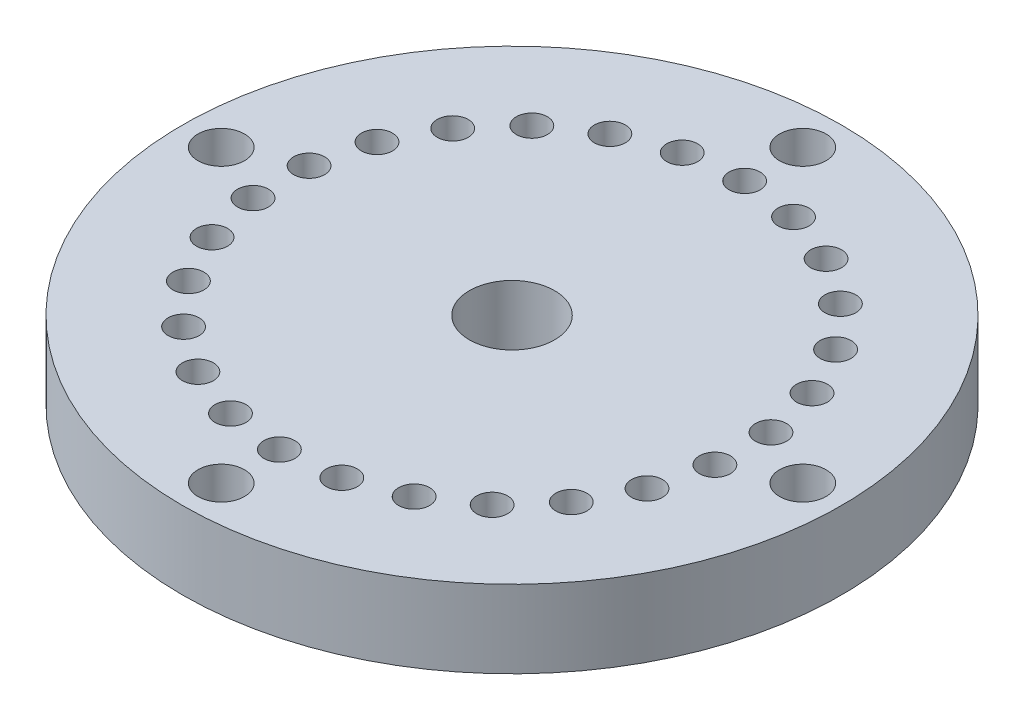
ISO-10303-21;
HEADER;
FILE_DESCRIPTION(('STEP AP214'),'2;1');
FILE_NAME('part.step','',(''),(''),'','','');
FILE_SCHEMA(('AUTOMOTIVE_DESIGN { 1 0 10303 214 1 1 1 1 }'));
ENDSEC;
DATA;
#1=APPLICATION_CONTEXT('core data for automotive mechanical design processes');
#2=APPLICATION_PROTOCOL_DEFINITION('international standard','automotive_design',2000,#1);
#3=PRODUCT_CONTEXT('',#1,'mechanical');
#4=PRODUCT('Part','Part','',(#3));
#5=PRODUCT_RELATED_PRODUCT_CATEGORY('part','',(#4));
#6=PRODUCT_DEFINITION_FORMATION('','',#4);
#7=PRODUCT_DEFINITION_CONTEXT('part definition',#1,'design');
#8=PRODUCT_DEFINITION('design','',#6,#7);
#9=PRODUCT_DEFINITION_SHAPE('','',#8);
#10=(LENGTH_UNIT() NAMED_UNIT(*) SI_UNIT(.MILLI.,.METRE.));
#11=(NAMED_UNIT(*) PLANE_ANGLE_UNIT() SI_UNIT($,.RADIAN.));
#12=(NAMED_UNIT(*) SI_UNIT($,.STERADIAN.) SOLID_ANGLE_UNIT());
#13=UNCERTAINTY_MEASURE_WITH_UNIT(LENGTH_MEASURE(1.E-05),#10,'distance_accuracy_value','');
#14=(GEOMETRIC_REPRESENTATION_CONTEXT(3) GLOBAL_UNCERTAINTY_ASSIGNED_CONTEXT((#13)) GLOBAL_UNIT_ASSIGNED_CONTEXT((#10,
#11,#12)) REPRESENTATION_CONTEXT('',''));
#15=CARTESIAN_POINT('',(0.,0.,0.));
#16=DIRECTION('',(0.,0.,1.));
#17=DIRECTION('',(1.,0.,0.));
#18=AXIS2_PLACEMENT_3D('',#15,#16,#17);
#19=CARTESIAN_POINT('',(0.,1.,0.));
#20=DIRECTION('',(0.,1.,0.));
#21=DIRECTION('',(0.,0.,1.));
#22=AXIS2_PLACEMENT_3D('',#19,#20,#21);
#23=PLANE('',#22);
#24=CARTESIAN_POINT('',(2.1224433562867E-13,1.,3.75));
#25=DIRECTION('',(0.,1.,0.));
#26=DIRECTION('',(0.,0.,1.));
#27=AXIS2_PLACEMENT_3D('',#24,#25,#26);
#28=CIRCLE('',#27,0.300000000000228);
#29=CARTESIAN_POINT('',(2.1224433562867E-13,1.,4.05000000000023));
#30=VERTEX_POINT('',#29);
#31=EDGE_CURVE('E217',#30,#30,#28,.T.);
#32=ORIENTED_EDGE('',*,*,#31,.F.);
#33=EDGE_LOOP('',(#32));
#34=FACE_BOUND('',#33,.T.);
#35=CARTESIAN_POINT('',(-0.717946992862634,1.,-2.91282545227817));
#36=DIRECTION('',(0.,1.,0.));
#37=DIRECTION('',(0.,0.,1.));
#38=AXIS2_PLACEMENT_3D('',#35,#36,#37);
#39=CIRCLE('',#38,0.2);
#40=CARTESIAN_POINT('',(-0.717946992862634,1.,-2.71282545227817));
#41=VERTEX_POINT('',#40);
#42=EDGE_CURVE('E205',#41,#41,#39,.T.);
#43=ORIENTED_EDGE('',*,*,#42,.F.);
#44=EDGE_LOOP('',(#43));
#45=FACE_BOUND('',#44,.T.);
#46=CARTESIAN_POINT('',(-1.98936797472234,1.,-2.24553224451319));
#47=DIRECTION('',(0.,1.,0.));
#48=DIRECTION('',(0.,0.,1.));
#49=AXIS2_PLACEMENT_3D('',#46,#47,#48);
#50=CIRCLE('',#49,0.20000000000011);
#51=CARTESIAN_POINT('',(-1.98936797472234,1.,-2.04553224451308));
#52=VERTEX_POINT('',#51);
#53=EDGE_CURVE('E193',#52,#52,#50,.T.);
#54=ORIENTED_EDGE('',*,*,#53,.F.);
#55=EDGE_LOOP('',(#54));
#56=FACE_BOUND('',#55,.T.);
#57=CARTESIAN_POINT('',(-2.80504872805614,1.,-1.06381466112745));
#58=DIRECTION('',(0.,1.,0.));
#59=DIRECTION('',(0.,0.,1.));
#60=AXIS2_PLACEMENT_3D('',#57,#58,#59);
#61=CIRCLE('',#60,0.200000000000185);
#62=CARTESIAN_POINT('',(-2.80504872805614,1.,-0.863814661127263));
#63=VERTEX_POINT('',#62);
#64=EDGE_CURVE('E181',#63,#63,#61,.T.);
#65=ORIENTED_EDGE('',*,*,#64,.F.);
#66=EDGE_LOOP('',(#65));
#67=FACE_BOUND('',#66,.T.);
#68=CARTESIAN_POINT('',(-2.97812662229397,1.,0.36161004076614));
#69=DIRECTION('',(0.,1.,0.));
#70=DIRECTION('',(0.,0.,1.));
#71=AXIS2_PLACEMENT_3D('',#68,#69,#70);
#72=CIRCLE('',#71,0.200000000000262);
#73=CARTESIAN_POINT('',(-2.97812662229397,1.,0.561610040766402));
#74=VERTEX_POINT('',#73);
#75=EDGE_CURVE('E169',#74,#74,#72,.T.);
#76=ORIENTED_EDGE('',*,*,#75,.F.);
#77=EDGE_LOOP('',(#76));
#78=FACE_BOUND('',#77,.T.);
#79=CARTESIAN_POINT('',(-2.4689515976807,1.,1.70419424019361));
#80=DIRECTION('',(0.,1.,0.));
#81=DIRECTION('',(0.,0.,1.));
#82=AXIS2_PLACEMENT_3D('',#79,#80,#81);
#83=CIRCLE('',#82,0.200000000000322);
#84=CARTESIAN_POINT('',(-2.4689515976807,1.,1.90419424019393));
#85=VERTEX_POINT('',#84);
#86=EDGE_CURVE('E157',#85,#85,#83,.T.);
#87=ORIENTED_EDGE('',*,*,#86,.F.);
#88=EDGE_LOOP('',(#87));
#89=FACE_BOUND('',#88,.T.);
#90=CARTESIAN_POINT('',(-1.39416951613099,1.,2.65636807695971));
#91=DIRECTION('',(0.,1.,0.));
#92=DIRECTION('',(0.,0.,1.));
#93=AXIS2_PLACEMENT_3D('',#90,#91,#92);
#94=CIRCLE('',#93,0.200000000000352);
#95=CARTESIAN_POINT('',(-1.39416951613099,1.,2.85636807696006));
#96=VERTEX_POINT('',#95);
#97=EDGE_CURVE('E145',#96,#96,#94,.T.);
#98=ORIENTED_EDGE('',*,*,#97,.F.);
#99=EDGE_LOOP('',(#98));
#100=FACE_BOUND('',#99,.T.);
#101=CARTESIAN_POINT('',(3.4032572508536E-13,1.,3.));
#102=DIRECTION('',(0.,1.,0.));
#103=DIRECTION('',(0.,0.,1.));
#104=AXIS2_PLACEMENT_3D('',#101,#102,#103);
#105=CIRCLE('',#104,0.200000000000346);
#106=CARTESIAN_POINT('',(3.4032572508536E-13,1.,3.20000000000035));
#107=VERTEX_POINT('',#106);
#108=EDGE_CURVE('E133',#107,#107,#105,.T.);
#109=ORIENTED_EDGE('',*,*,#108,.F.);
#110=EDGE_LOOP('',(#109));
#111=FACE_BOUND('',#110,.T.);
#112=CARTESIAN_POINT('',(1.39416951613163,1.,2.65636807695955));
#113=DIRECTION('',(0.,1.,0.));
#114=DIRECTION('',(0.,0.,1.));
#115=AXIS2_PLACEMENT_3D('',#112,#113,#114);
#116=CIRCLE('',#115,0.200000000000302);
#117=CARTESIAN_POINT('',(1.39416951613163,1.,2.85636807695985));
#118=VERTEX_POINT('',#117);
#119=EDGE_CURVE('E121',#118,#118,#116,.T.);
#120=ORIENTED_EDGE('',*,*,#119,.F.);
#121=EDGE_LOOP('',(#120));
#122=FACE_BOUND('',#121,.T.);
#123=CARTESIAN_POINT('',(2.46895159768124,1.,1.70419424019333));
#124=DIRECTION('',(0.,1.,0.));
#125=DIRECTION('',(0.,0.,1.));
#126=AXIS2_PLACEMENT_3D('',#123,#124,#125);
#127=CIRCLE('',#126,0.200000000000228);
#128=CARTESIAN_POINT('',(2.46895159768124,1.,1.90419424019356));
#129=VERTEX_POINT('',#128);
#130=EDGE_CURVE('E109',#129,#129,#127,.T.);
#131=ORIENTED_EDGE('',*,*,#130,.F.);
#132=EDGE_LOOP('',(#131));
#133=FACE_BOUND('',#132,.T.);
#134=CARTESIAN_POINT('',(2.97812662229435,1.,0.3616100407658));
#135=DIRECTION('',(0.,1.,0.));
#136=DIRECTION('',(0.,0.,1.));
#137=AXIS2_PLACEMENT_3D('',#134,#135,#136);
#138=CIRCLE('',#137,0.200000000000144);
#139=CARTESIAN_POINT('',(2.97812662229435,1.,0.561610040765944));
#140=VERTEX_POINT('',#139);
#141=EDGE_CURVE('E97',#140,#140,#138,.T.);
#142=ORIENTED_EDGE('',*,*,#141,.F.);
#143=EDGE_LOOP('',(#142));
#144=FACE_BOUND('',#143,.T.);
#145=CARTESIAN_POINT('',(2.80504872805635,1.,-1.06381466112777));
#146=DIRECTION('',(0.,1.,0.));
#147=DIRECTION('',(0.,0.,1.));
#148=AXIS2_PLACEMENT_3D('',#145,#146,#147);
#149=CIRCLE('',#148,0.200000000000066);
#150=CARTESIAN_POINT('',(2.80504872805635,1.,-0.8638146611277));
#151=VERTEX_POINT('',#150);
#152=EDGE_CURVE('E85',#151,#151,#149,.T.);
#153=ORIENTED_EDGE('',*,*,#152,.F.);
#154=EDGE_LOOP('',(#153));
#155=FACE_BOUND('',#154,.T.);
#156=CARTESIAN_POINT('',(1.98936797472243,1.,-2.24553224451342));
#157=DIRECTION('',(0.,1.,0.));
#158=DIRECTION('',(0.,0.,1.));
#159=AXIS2_PLACEMENT_3D('',#156,#157,#158);
#160=CIRCLE('',#159,0.200000000000013);
#161=CARTESIAN_POINT('',(1.98936797472243,1.,-2.0455322445134));
#162=VERTEX_POINT('',#161);
#163=EDGE_CURVE('E73',#162,#162,#160,.T.);
#164=ORIENTED_EDGE('',*,*,#163,.F.);
#165=EDGE_LOOP('',(#164));
#166=FACE_BOUND('',#165,.T.);
#167=CARTESIAN_POINT('',(0.717946992862675,1.,-2.91282545227816));
#168=DIRECTION('',(0.,1.,0.));
#169=DIRECTION('',(0.,0.,1.));
#170=AXIS2_PLACEMENT_3D('',#167,#168,#169);
#171=CIRCLE('',#170,0.2);
#172=CARTESIAN_POINT('',(0.717946992862675,1.,-2.71282545227816));
#173=VERTEX_POINT('',#172);
#174=EDGE_CURVE('E61',#173,#173,#171,.T.);
#175=ORIENTED_EDGE('',*,*,#174,.F.);
#176=EDGE_LOOP('',(#175));
#177=FACE_BOUND('',#176,.T.);
#178=CARTESIAN_POINT('',(0.,1.,-3.75));
#179=DIRECTION('',(0.,1.,0.));
#180=DIRECTION('',(0.,0.,1.));
#181=AXIS2_PLACEMENT_3D('',#178,#179,#180);
#182=CIRCLE('',#181,0.3);
#183=CARTESIAN_POINT('',(0.,1.,-3.45));
#184=VERTEX_POINT('',#183);
#185=EDGE_CURVE('E49',#184,#184,#182,.T.);
#186=ORIENTED_EDGE('',*,*,#185,.F.);
#187=EDGE_LOOP('',(#186));
#188=FACE_BOUND('',#187,.T.);
#189=CARTESIAN_POINT('',(0.,1.,0.));
#190=DIRECTION('',(0.,1.,0.));
#191=DIRECTION('',(0.,0.,1.));
#192=AXIS2_PLACEMENT_3D('',#189,#190,#191);
#193=CIRCLE('',#192,4.25);
#194=CARTESIAN_POINT('',(0.,1.,4.25));
#195=VERTEX_POINT('',#194);
#196=EDGE_CURVE('E10',#195,#195,#193,.T.);
#197=ORIENTED_EDGE('',*,*,#196,.T.);
#198=EDGE_LOOP('',(#197));
#199=FACE_BOUND('',#198,.T.);
#200=CARTESIAN_POINT('',(0.,1.,0.));
#201=DIRECTION('',(0.,1.,0.));
#202=DIRECTION('',(0.,0.,1.));
#203=AXIS2_PLACEMENT_3D('',#200,#201,#202);
#204=CIRCLE('',#203,0.55);
#205=CARTESIAN_POINT('',(0.,1.,0.55));
#206=VERTEX_POINT('',#205);
#207=EDGE_CURVE('E44',#206,#206,#204,.T.);
#208=ORIENTED_EDGE('',*,*,#207,.F.);
#209=EDGE_LOOP('',(#208));
#210=FACE_BOUND('',#209,.T.);
#211=CARTESIAN_POINT('',(0.,1.,-3.));
#212=DIRECTION('',(0.,1.,0.));
#213=DIRECTION('',(0.,0.,1.));
#214=AXIS2_PLACEMENT_3D('',#211,#212,#213);
#215=CIRCLE('',#214,0.2);
#216=CARTESIAN_POINT('',(0.,1.,-2.8));
#217=VERTEX_POINT('',#216);
#218=EDGE_CURVE('E55',#217,#217,#215,.T.);
#219=ORIENTED_EDGE('',*,*,#218,.F.);
#220=EDGE_LOOP('',(#219));
#221=FACE_BOUND('',#220,.T.);
#222=CARTESIAN_POINT('',(1.39416951613133,1.,-2.65636807695971));
#223=DIRECTION('',(0.,1.,0.));
#224=DIRECTION('',(0.,0.,1.));
#225=AXIS2_PLACEMENT_3D('',#222,#223,#224);
#226=CIRCLE('',#225,0.199999999999999);
#227=CARTESIAN_POINT('',(1.39416951613133,1.,-2.45636807695971));
#228=VERTEX_POINT('',#227);
#229=EDGE_CURVE('E67',#228,#228,#226,.T.);
#230=ORIENTED_EDGE('',*,*,#229,.F.);
#231=EDGE_LOOP('',(#230));
#232=FACE_BOUND('',#231,.T.);
#233=CARTESIAN_POINT('',(2.46895159768104,1.,-1.70419424019361));
#234=DIRECTION('',(0.,1.,0.));
#235=DIRECTION('',(0.,0.,1.));
#236=AXIS2_PLACEMENT_3D('',#233,#234,#235);
#237=CIRCLE('',#236,0.200000000000036);
#238=CARTESIAN_POINT('',(2.46895159768104,1.,-1.50419424019357));
#239=VERTEX_POINT('',#238);
#240=EDGE_CURVE('E79',#239,#239,#237,.T.);
#241=ORIENTED_EDGE('',*,*,#240,.F.);
#242=EDGE_LOOP('',(#241));
#243=FACE_BOUND('',#242,.T.);
#244=CARTESIAN_POINT('',(2.97812662229431,1.,-0.361610040766138));
#245=DIRECTION('',(0.,1.,0.));
#246=DIRECTION('',(0.,0.,1.));
#247=AXIS2_PLACEMENT_3D('',#244,#245,#246);
#248=CIRCLE('',#247,0.200000000000103);
#249=CARTESIAN_POINT('',(2.97812662229431,1.,-0.161610040766035));
#250=VERTEX_POINT('',#249);
#251=EDGE_CURVE('E91',#250,#250,#248,.T.);
#252=ORIENTED_EDGE('',*,*,#251,.F.);
#253=EDGE_LOOP('',(#252));
#254=FACE_BOUND('',#253,.T.);
#255=CARTESIAN_POINT('',(2.80504872805647,1.,1.06381466112745));
#256=DIRECTION('',(0.,1.,0.));
#257=DIRECTION('',(0.,0.,1.));
#258=AXIS2_PLACEMENT_3D('',#255,#256,#257);
#259=CIRCLE('',#258,0.200000000000187);
#260=CARTESIAN_POINT('',(2.80504872805647,1.,1.26381466112763));
#261=VERTEX_POINT('',#260);
#262=EDGE_CURVE('E103',#261,#261,#259,.T.);
#263=ORIENTED_EDGE('',*,*,#262,.F.);
#264=EDGE_LOOP('',(#263));
#265=FACE_BOUND('',#264,.T.);
#266=CARTESIAN_POINT('',(1.98936797472268,1.,2.24553224451319));
#267=DIRECTION('',(0.,1.,0.));
#268=DIRECTION('',(0.,0.,1.));
#269=AXIS2_PLACEMENT_3D('',#266,#267,#268);
#270=CIRCLE('',#269,0.200000000000268);
#271=CARTESIAN_POINT('',(1.98936797472268,1.,2.44553224451346));
#272=VERTEX_POINT('',#271);
#273=EDGE_CURVE('E115',#272,#272,#270,.T.);
#274=ORIENTED_EDGE('',*,*,#273,.F.);
#275=EDGE_LOOP('',(#274));
#276=FACE_BOUND('',#275,.T.);
#277=CARTESIAN_POINT('',(0.717946992863009,1.,2.91282545227812));
#278=DIRECTION('',(0.,1.,0.));
#279=DIRECTION('',(0.,0.,1.));
#280=AXIS2_PLACEMENT_3D('',#277,#278,#279);
#281=CIRCLE('',#280,0.200000000000327);
#282=CARTESIAN_POINT('',(0.717946992863009,1.,3.11282545227844));
#283=VERTEX_POINT('',#282);
#284=EDGE_CURVE('E127',#283,#283,#281,.T.);
#285=ORIENTED_EDGE('',*,*,#284,.F.);
#286=EDGE_LOOP('',(#285));
#287=FACE_BOUND('',#286,.T.);
#288=CARTESIAN_POINT('',(-0.717946992862337,1.,2.9128254522782));
#289=DIRECTION('',(0.,1.,0.));
#290=DIRECTION('',(0.,0.,1.));
#291=AXIS2_PLACEMENT_3D('',#288,#289,#290);
#292=CIRCLE('',#291,0.200000000000355);
#293=CARTESIAN_POINT('',(-0.717946992862337,1.,3.11282545227855));
#294=VERTEX_POINT('',#293);
#295=EDGE_CURVE('E139',#294,#294,#292,.T.);
#296=ORIENTED_EDGE('',*,*,#295,.F.);
#297=EDGE_LOOP('',(#296));
#298=FACE_BOUND('',#297,.T.);
#299=CARTESIAN_POINT('',(-1.98936797472209,1.,2.24553224451342));
#300=DIRECTION('',(0.,1.,0.));
#301=DIRECTION('',(0.,0.,1.));
#302=AXIS2_PLACEMENT_3D('',#299,#300,#301);
#303=CIRCLE('',#302,0.200000000000342);
#304=CARTESIAN_POINT('',(-1.98936797472209,1.,2.44553224451376));
#305=VERTEX_POINT('',#304);
#306=EDGE_CURVE('E151',#305,#305,#303,.T.);
#307=ORIENTED_EDGE('',*,*,#306,.F.);
#308=EDGE_LOOP('',(#307));
#309=FACE_BOUND('',#308,.T.);
#310=CARTESIAN_POINT('',(-2.80504872805601,1.,1.06381466112777));
#311=DIRECTION('',(0.,1.,0.));
#312=DIRECTION('',(0.,0.,1.));
#313=AXIS2_PLACEMENT_3D('',#310,#311,#312);
#314=CIRCLE('',#313,0.200000000000295);
#315=CARTESIAN_POINT('',(-2.80504872805601,1.,1.26381466112806));
#316=VERTEX_POINT('',#315);
#317=EDGE_CURVE('E163',#316,#316,#314,.T.);
#318=ORIENTED_EDGE('',*,*,#317,.F.);
#319=EDGE_LOOP('',(#318));
#320=FACE_BOUND('',#319,.T.);
#321=CARTESIAN_POINT('',(-2.97812662229401,1.,-0.361610040765798));
#322=DIRECTION('',(0.,1.,0.));
#323=DIRECTION('',(0.,0.,1.));
#324=AXIS2_PLACEMENT_3D('',#321,#322,#323);
#325=CIRCLE('',#324,0.200000000000225);
#326=CARTESIAN_POINT('',(-2.97812662229401,1.,-0.161610040765573));
#327=VERTEX_POINT('',#326);
#328=EDGE_CURVE('E175',#327,#327,#325,.T.);
#329=ORIENTED_EDGE('',*,*,#328,.F.);
#330=EDGE_LOOP('',(#329));
#331=FACE_BOUND('',#330,.T.);
#332=CARTESIAN_POINT('',(-2.4689515976809,1.,-1.70419424019333));
#333=DIRECTION('',(0.,1.,0.));
#334=DIRECTION('',(0.,0.,1.));
#335=AXIS2_PLACEMENT_3D('',#332,#333,#334);
#336=CIRCLE('',#335,0.200000000000147);
#337=CARTESIAN_POINT('',(-2.4689515976809,1.,-1.50419424019318));
#338=VERTEX_POINT('',#337);
#339=EDGE_CURVE('E187',#338,#338,#336,.T.);
#340=ORIENTED_EDGE('',*,*,#339,.F.);
#341=EDGE_LOOP('',(#340));
#342=FACE_BOUND('',#341,.T.);
#343=CARTESIAN_POINT('',(-1.39416951613129,1.,-2.65636807695955));
#344=DIRECTION('',(0.,1.,0.));
#345=DIRECTION('',(0.,0.,1.));
#346=AXIS2_PLACEMENT_3D('',#343,#344,#345);
#347=CIRCLE('',#346,0.20000000000008);
#348=CARTESIAN_POINT('',(-1.39416951613129,1.,-2.45636807695947));
#349=VERTEX_POINT('',#348);
#350=EDGE_CURVE('E199',#349,#349,#347,.T.);
#351=ORIENTED_EDGE('',*,*,#350,.F.);
#352=EDGE_LOOP('',(#351));
#353=FACE_BOUND('',#352,.T.);
#354=CARTESIAN_POINT('',(3.75000000000011,1.,-1.06122167814335E-13));
#355=DIRECTION('',(0.,1.,0.));
#356=DIRECTION('',(0.,0.,1.));
#357=AXIS2_PLACEMENT_3D('',#354,#355,#356);
#358=CIRCLE('',#357,0.300000000000083);
#359=CARTESIAN_POINT('',(3.75000000000011,1.,0.299999999999977));
#360=VERTEX_POINT('',#359);
#361=EDGE_CURVE('E211',#360,#360,#358,.T.);
#362=ORIENTED_EDGE('',*,*,#361,.F.);
#363=EDGE_LOOP('',(#362));
#364=FACE_BOUND('',#363,.T.);
#365=CARTESIAN_POINT('',(-3.74999999999989,1.,1.06581410364015E-13));
#366=DIRECTION('',(0.,1.,0.));
#367=DIRECTION('',(0.,0.,1.));
#368=AXIS2_PLACEMENT_3D('',#365,#366,#367);
#369=CIRCLE('',#368,0.30000000000017);
#370=CARTESIAN_POINT('',(-3.74999999999989,1.,0.300000000000277));
#371=VERTEX_POINT('',#370);
#372=EDGE_CURVE('E223',#371,#371,#369,.T.);
#373=ORIENTED_EDGE('',*,*,#372,.F.);
#374=EDGE_LOOP('',(#373));
#375=FACE_BOUND('',#374,.T.);
#376=ADVANCED_FACE('F33',(#34,#45,#56,#67,#78,#89,#100,#111,#122,#133,#144,#155,#166,#177,#188,
#199,#210,#221,#232,#243,#254,#265,#276,#287,#298,#309,#320,#331,#342,#353,#364,#375),#23,.T.);
#377=CARTESIAN_POINT('',(0.,0.,0.));
#378=DIRECTION('',(0.,1.,0.));
#379=DIRECTION('',(0.,0.,1.));
#380=AXIS2_PLACEMENT_3D('',#377,#378,#379);
#381=PLANE('',#380);
#382=CARTESIAN_POINT('',(2.1224433562867E-13,0.,3.75));
#383=DIRECTION('',(0.,1.,0.));
#384=DIRECTION('',(0.,0.,1.));
#385=AXIS2_PLACEMENT_3D('',#382,#383,#384);
#386=CIRCLE('',#385,0.300000000000228);
#387=CARTESIAN_POINT('',(2.1224433562867E-13,0.,4.05000000000023));
#388=VERTEX_POINT('',#387);
#389=EDGE_CURVE('E220',#388,#388,#386,.T.);
#390=ORIENTED_EDGE('',*,*,#389,.T.);
#391=EDGE_LOOP('',(#390));
#392=FACE_BOUND('',#391,.T.);
#393=CARTESIAN_POINT('',(-0.717946992862634,0.,-2.91282545227817));
#394=DIRECTION('',(0.,1.,0.));
#395=DIRECTION('',(0.,0.,1.));
#396=AXIS2_PLACEMENT_3D('',#393,#394,#395);
#397=CIRCLE('',#396,0.2);
#398=CARTESIAN_POINT('',(-0.717946992862634,0.,-2.71282545227817));
#399=VERTEX_POINT('',#398);
#400=EDGE_CURVE('E208',#399,#399,#397,.T.);
#401=ORIENTED_EDGE('',*,*,#400,.T.);
#402=EDGE_LOOP('',(#401));
#403=FACE_BOUND('',#402,.T.);
#404=CARTESIAN_POINT('',(-1.98936797472234,0.,-2.24553224451319));
#405=DIRECTION('',(0.,1.,0.));
#406=DIRECTION('',(0.,0.,1.));
#407=AXIS2_PLACEMENT_3D('',#404,#405,#406);
#408=CIRCLE('',#407,0.20000000000011);
#409=CARTESIAN_POINT('',(-1.98936797472234,0.,-2.04553224451308));
#410=VERTEX_POINT('',#409);
#411=EDGE_CURVE('E196',#410,#410,#408,.T.);
#412=ORIENTED_EDGE('',*,*,#411,.T.);
#413=EDGE_LOOP('',(#412));
#414=FACE_BOUND('',#413,.T.);
#415=CARTESIAN_POINT('',(-2.80504872805614,0.,-1.06381466112745));
#416=DIRECTION('',(0.,1.,0.));
#417=DIRECTION('',(0.,0.,1.));
#418=AXIS2_PLACEMENT_3D('',#415,#416,#417);
#419=CIRCLE('',#418,0.200000000000185);
#420=CARTESIAN_POINT('',(-2.80504872805614,0.,-0.863814661127263));
#421=VERTEX_POINT('',#420);
#422=EDGE_CURVE('E184',#421,#421,#419,.T.);
#423=ORIENTED_EDGE('',*,*,#422,.T.);
#424=EDGE_LOOP('',(#423));
#425=FACE_BOUND('',#424,.T.);
#426=CARTESIAN_POINT('',(-2.97812662229397,0.,0.36161004076614));
#427=DIRECTION('',(0.,1.,0.));
#428=DIRECTION('',(0.,0.,1.));
#429=AXIS2_PLACEMENT_3D('',#426,#427,#428);
#430=CIRCLE('',#429,0.200000000000262);
#431=CARTESIAN_POINT('',(-2.97812662229397,0.,0.561610040766402));
#432=VERTEX_POINT('',#431);
#433=EDGE_CURVE('E172',#432,#432,#430,.T.);
#434=ORIENTED_EDGE('',*,*,#433,.T.);
#435=EDGE_LOOP('',(#434));
#436=FACE_BOUND('',#435,.T.);
#437=CARTESIAN_POINT('',(-2.4689515976807,0.,1.70419424019361));
#438=DIRECTION('',(0.,1.,0.));
#439=DIRECTION('',(0.,0.,1.));
#440=AXIS2_PLACEMENT_3D('',#437,#438,#439);
#441=CIRCLE('',#440,0.200000000000322);
#442=CARTESIAN_POINT('',(-2.4689515976807,0.,1.90419424019393));
#443=VERTEX_POINT('',#442);
#444=EDGE_CURVE('E160',#443,#443,#441,.T.);
#445=ORIENTED_EDGE('',*,*,#444,.T.);
#446=EDGE_LOOP('',(#445));
#447=FACE_BOUND('',#446,.T.);
#448=CARTESIAN_POINT('',(-1.39416951613099,0.,2.65636807695971));
#449=DIRECTION('',(0.,1.,0.));
#450=DIRECTION('',(0.,0.,1.));
#451=AXIS2_PLACEMENT_3D('',#448,#449,#450);
#452=CIRCLE('',#451,0.200000000000352);
#453=CARTESIAN_POINT('',(-1.39416951613099,0.,2.85636807696006));
#454=VERTEX_POINT('',#453);
#455=EDGE_CURVE('E148',#454,#454,#452,.T.);
#456=ORIENTED_EDGE('',*,*,#455,.T.);
#457=EDGE_LOOP('',(#456));
#458=FACE_BOUND('',#457,.T.);
#459=CARTESIAN_POINT('',(3.4032572508536E-13,0.,3.));
#460=DIRECTION('',(0.,1.,0.));
#461=DIRECTION('',(0.,0.,1.));
#462=AXIS2_PLACEMENT_3D('',#459,#460,#461);
#463=CIRCLE('',#462,0.200000000000346);
#464=CARTESIAN_POINT('',(3.4032572508536E-13,0.,3.20000000000035));
#465=VERTEX_POINT('',#464);
#466=EDGE_CURVE('E136',#465,#465,#463,.T.);
#467=ORIENTED_EDGE('',*,*,#466,.T.);
#468=EDGE_LOOP('',(#467));
#469=FACE_BOUND('',#468,.T.);
#470=CARTESIAN_POINT('',(1.39416951613163,0.,2.65636807695955));
#471=DIRECTION('',(0.,1.,0.));
#472=DIRECTION('',(0.,0.,1.));
#473=AXIS2_PLACEMENT_3D('',#470,#471,#472);
#474=CIRCLE('',#473,0.200000000000302);
#475=CARTESIAN_POINT('',(1.39416951613163,0.,2.85636807695985));
#476=VERTEX_POINT('',#475);
#477=EDGE_CURVE('E124',#476,#476,#474,.T.);
#478=ORIENTED_EDGE('',*,*,#477,.T.);
#479=EDGE_LOOP('',(#478));
#480=FACE_BOUND('',#479,.T.);
#481=CARTESIAN_POINT('',(2.46895159768124,0.,1.70419424019333));
#482=DIRECTION('',(0.,1.,0.));
#483=DIRECTION('',(0.,0.,1.));
#484=AXIS2_PLACEMENT_3D('',#481,#482,#483);
#485=CIRCLE('',#484,0.200000000000228);
#486=CARTESIAN_POINT('',(2.46895159768124,0.,1.90419424019356));
#487=VERTEX_POINT('',#486);
#488=EDGE_CURVE('E112',#487,#487,#485,.T.);
#489=ORIENTED_EDGE('',*,*,#488,.T.);
#490=EDGE_LOOP('',(#489));
#491=FACE_BOUND('',#490,.T.);
#492=CARTESIAN_POINT('',(2.97812662229435,0.,0.3616100407658));
#493=DIRECTION('',(0.,1.,0.));
#494=DIRECTION('',(0.,0.,1.));
#495=AXIS2_PLACEMENT_3D('',#492,#493,#494);
#496=CIRCLE('',#495,0.200000000000144);
#497=CARTESIAN_POINT('',(2.97812662229435,0.,0.561610040765944));
#498=VERTEX_POINT('',#497);
#499=EDGE_CURVE('E100',#498,#498,#496,.T.);
#500=ORIENTED_EDGE('',*,*,#499,.T.);
#501=EDGE_LOOP('',(#500));
#502=FACE_BOUND('',#501,.T.);
#503=CARTESIAN_POINT('',(2.80504872805635,0.,-1.06381466112777));
#504=DIRECTION('',(0.,1.,0.));
#505=DIRECTION('',(0.,0.,1.));
#506=AXIS2_PLACEMENT_3D('',#503,#504,#505);
#507=CIRCLE('',#506,0.200000000000066);
#508=CARTESIAN_POINT('',(2.80504872805635,0.,-0.8638146611277));
#509=VERTEX_POINT('',#508);
#510=EDGE_CURVE('E88',#509,#509,#507,.T.);
#511=ORIENTED_EDGE('',*,*,#510,.T.);
#512=EDGE_LOOP('',(#511));
#513=FACE_BOUND('',#512,.T.);
#514=CARTESIAN_POINT('',(1.98936797472243,0.,-2.24553224451342));
#515=DIRECTION('',(0.,1.,0.));
#516=DIRECTION('',(0.,0.,1.));
#517=AXIS2_PLACEMENT_3D('',#514,#515,#516);
#518=CIRCLE('',#517,0.200000000000013);
#519=CARTESIAN_POINT('',(1.98936797472243,0.,-2.0455322445134));
#520=VERTEX_POINT('',#519);
#521=EDGE_CURVE('E76',#520,#520,#518,.T.);
#522=ORIENTED_EDGE('',*,*,#521,.T.);
#523=EDGE_LOOP('',(#522));
#524=FACE_BOUND('',#523,.T.);
#525=CARTESIAN_POINT('',(0.717946992862675,0.,-2.91282545227816));
#526=DIRECTION('',(0.,1.,0.));
#527=DIRECTION('',(0.,0.,1.));
#528=AXIS2_PLACEMENT_3D('',#525,#526,#527);
#529=CIRCLE('',#528,0.2);
#530=CARTESIAN_POINT('',(0.717946992862675,0.,-2.71282545227816));
#531=VERTEX_POINT('',#530);
#532=EDGE_CURVE('E64',#531,#531,#529,.T.);
#533=ORIENTED_EDGE('',*,*,#532,.T.);
#534=EDGE_LOOP('',(#533));
#535=FACE_BOUND('',#534,.T.);
#536=CARTESIAN_POINT('',(0.,0.,-3.75));
#537=DIRECTION('',(0.,1.,0.));
#538=DIRECTION('',(0.,0.,1.));
#539=AXIS2_PLACEMENT_3D('',#536,#537,#538);
#540=CIRCLE('',#539,0.3);
#541=CARTESIAN_POINT('',(0.,0.,-3.45));
#542=VERTEX_POINT('',#541);
#543=EDGE_CURVE('E52',#542,#542,#540,.T.);
#544=ORIENTED_EDGE('',*,*,#543,.T.);
#545=EDGE_LOOP('',(#544));
#546=FACE_BOUND('',#545,.T.);
#547=CARTESIAN_POINT('',(0.,0.,0.));
#548=DIRECTION('',(0.,1.,0.));
#549=DIRECTION('',(0.,0.,1.));
#550=AXIS2_PLACEMENT_3D('',#547,#548,#549);
#551=CIRCLE('',#550,4.25);
#552=CARTESIAN_POINT('',(0.,0.,4.25));
#553=VERTEX_POINT('',#552);
#554=EDGE_CURVE('E37',#553,#553,#551,.T.);
#555=ORIENTED_EDGE('',*,*,#554,.F.);
#556=EDGE_LOOP('',(#555));
#557=FACE_BOUND('',#556,.T.);
#558=CARTESIAN_POINT('',(0.,0.,0.));
#559=DIRECTION('',(0.,1.,0.));
#560=DIRECTION('',(0.,0.,1.));
#561=AXIS2_PLACEMENT_3D('',#558,#559,#560);
#562=CIRCLE('',#561,0.55);
#563=CARTESIAN_POINT('',(0.,0.,0.55));
#564=VERTEX_POINT('',#563);
#565=EDGE_CURVE('E46',#564,#564,#562,.T.);
#566=ORIENTED_EDGE('',*,*,#565,.T.);
#567=EDGE_LOOP('',(#566));
#568=FACE_BOUND('',#567,.T.);
#569=CARTESIAN_POINT('',(0.,0.,-3.));
#570=DIRECTION('',(0.,1.,0.));
#571=DIRECTION('',(0.,0.,1.));
#572=AXIS2_PLACEMENT_3D('',#569,#570,#571);
#573=CIRCLE('',#572,0.2);
#574=CARTESIAN_POINT('',(0.,0.,-2.8));
#575=VERTEX_POINT('',#574);
#576=EDGE_CURVE('E58',#575,#575,#573,.T.);
#577=ORIENTED_EDGE('',*,*,#576,.T.);
#578=EDGE_LOOP('',(#577));
#579=FACE_BOUND('',#578,.T.);
#580=CARTESIAN_POINT('',(1.39416951613133,0.,-2.65636807695971));
#581=DIRECTION('',(0.,1.,0.));
#582=DIRECTION('',(0.,0.,1.));
#583=AXIS2_PLACEMENT_3D('',#580,#581,#582);
#584=CIRCLE('',#583,0.199999999999999);
#585=CARTESIAN_POINT('',(1.39416951613133,0.,-2.45636807695971));
#586=VERTEX_POINT('',#585);
#587=EDGE_CURVE('E70',#586,#586,#584,.T.);
#588=ORIENTED_EDGE('',*,*,#587,.T.);
#589=EDGE_LOOP('',(#588));
#590=FACE_BOUND('',#589,.T.);
#591=CARTESIAN_POINT('',(2.46895159768104,0.,-1.70419424019361));
#592=DIRECTION('',(0.,1.,0.));
#593=DIRECTION('',(0.,0.,1.));
#594=AXIS2_PLACEMENT_3D('',#591,#592,#593);
#595=CIRCLE('',#594,0.200000000000036);
#596=CARTESIAN_POINT('',(2.46895159768104,0.,-1.50419424019357));
#597=VERTEX_POINT('',#596);
#598=EDGE_CURVE('E82',#597,#597,#595,.T.);
#599=ORIENTED_EDGE('',*,*,#598,.T.);
#600=EDGE_LOOP('',(#599));
#601=FACE_BOUND('',#600,.T.);
#602=CARTESIAN_POINT('',(2.97812662229431,0.,-0.361610040766138));
#603=DIRECTION('',(0.,1.,0.));
#604=DIRECTION('',(0.,0.,1.));
#605=AXIS2_PLACEMENT_3D('',#602,#603,#604);
#606=CIRCLE('',#605,0.200000000000103);
#607=CARTESIAN_POINT('',(2.97812662229431,0.,-0.161610040766035));
#608=VERTEX_POINT('',#607);
#609=EDGE_CURVE('E94',#608,#608,#606,.T.);
#610=ORIENTED_EDGE('',*,*,#609,.T.);
#611=EDGE_LOOP('',(#610));
#612=FACE_BOUND('',#611,.T.);
#613=CARTESIAN_POINT('',(2.80504872805647,0.,1.06381466112745));
#614=DIRECTION('',(0.,1.,0.));
#615=DIRECTION('',(0.,0.,1.));
#616=AXIS2_PLACEMENT_3D('',#613,#614,#615);
#617=CIRCLE('',#616,0.200000000000187);
#618=CARTESIAN_POINT('',(2.80504872805647,0.,1.26381466112763));
#619=VERTEX_POINT('',#618);
#620=EDGE_CURVE('E106',#619,#619,#617,.T.);
#621=ORIENTED_EDGE('',*,*,#620,.T.);
#622=EDGE_LOOP('',(#621));
#623=FACE_BOUND('',#622,.T.);
#624=CARTESIAN_POINT('',(1.98936797472268,0.,2.24553224451319));
#625=DIRECTION('',(0.,1.,0.));
#626=DIRECTION('',(0.,0.,1.));
#627=AXIS2_PLACEMENT_3D('',#624,#625,#626);
#628=CIRCLE('',#627,0.200000000000268);
#629=CARTESIAN_POINT('',(1.98936797472268,0.,2.44553224451346));
#630=VERTEX_POINT('',#629);
#631=EDGE_CURVE('E118',#630,#630,#628,.T.);
#632=ORIENTED_EDGE('',*,*,#631,.T.);
#633=EDGE_LOOP('',(#632));
#634=FACE_BOUND('',#633,.T.);
#635=CARTESIAN_POINT('',(0.717946992863009,0.,2.91282545227812));
#636=DIRECTION('',(0.,1.,0.));
#637=DIRECTION('',(0.,0.,1.));
#638=AXIS2_PLACEMENT_3D('',#635,#636,#637);
#639=CIRCLE('',#638,0.200000000000327);
#640=CARTESIAN_POINT('',(0.717946992863009,0.,3.11282545227844));
#641=VERTEX_POINT('',#640);
#642=EDGE_CURVE('E130',#641,#641,#639,.T.);
#643=ORIENTED_EDGE('',*,*,#642,.T.);
#644=EDGE_LOOP('',(#643));
#645=FACE_BOUND('',#644,.T.);
#646=CARTESIAN_POINT('',(-0.717946992862337,0.,2.9128254522782));
#647=DIRECTION('',(0.,1.,0.));
#648=DIRECTION('',(0.,0.,1.));
#649=AXIS2_PLACEMENT_3D('',#646,#647,#648);
#650=CIRCLE('',#649,0.200000000000355);
#651=CARTESIAN_POINT('',(-0.717946992862337,0.,3.11282545227855));
#652=VERTEX_POINT('',#651);
#653=EDGE_CURVE('E142',#652,#652,#650,.T.);
#654=ORIENTED_EDGE('',*,*,#653,.T.);
#655=EDGE_LOOP('',(#654));
#656=FACE_BOUND('',#655,.T.);
#657=CARTESIAN_POINT('',(-1.98936797472209,0.,2.24553224451342));
#658=DIRECTION('',(0.,1.,0.));
#659=DIRECTION('',(0.,0.,1.));
#660=AXIS2_PLACEMENT_3D('',#657,#658,#659);
#661=CIRCLE('',#660,0.200000000000342);
#662=CARTESIAN_POINT('',(-1.98936797472209,0.,2.44553224451376));
#663=VERTEX_POINT('',#662);
#664=EDGE_CURVE('E154',#663,#663,#661,.T.);
#665=ORIENTED_EDGE('',*,*,#664,.T.);
#666=EDGE_LOOP('',(#665));
#667=FACE_BOUND('',#666,.T.);
#668=CARTESIAN_POINT('',(-2.80504872805601,0.,1.06381466112777));
#669=DIRECTION('',(0.,1.,0.));
#670=DIRECTION('',(0.,0.,1.));
#671=AXIS2_PLACEMENT_3D('',#668,#669,#670);
#672=CIRCLE('',#671,0.200000000000295);
#673=CARTESIAN_POINT('',(-2.80504872805601,0.,1.26381466112806));
#674=VERTEX_POINT('',#673);
#675=EDGE_CURVE('E166',#674,#674,#672,.T.);
#676=ORIENTED_EDGE('',*,*,#675,.T.);
#677=EDGE_LOOP('',(#676));
#678=FACE_BOUND('',#677,.T.);
#679=CARTESIAN_POINT('',(-2.97812662229401,0.,-0.361610040765798));
#680=DIRECTION('',(0.,1.,0.));
#681=DIRECTION('',(0.,0.,1.));
#682=AXIS2_PLACEMENT_3D('',#679,#680,#681);
#683=CIRCLE('',#682,0.200000000000225);
#684=CARTESIAN_POINT('',(-2.97812662229401,0.,-0.161610040765573));
#685=VERTEX_POINT('',#684);
#686=EDGE_CURVE('E178',#685,#685,#683,.T.);
#687=ORIENTED_EDGE('',*,*,#686,.T.);
#688=EDGE_LOOP('',(#687));
#689=FACE_BOUND('',#688,.T.);
#690=CARTESIAN_POINT('',(-2.4689515976809,0.,-1.70419424019333));
#691=DIRECTION('',(0.,1.,0.));
#692=DIRECTION('',(0.,0.,1.));
#693=AXIS2_PLACEMENT_3D('',#690,#691,#692);
#694=CIRCLE('',#693,0.200000000000147);
#695=CARTESIAN_POINT('',(-2.4689515976809,0.,-1.50419424019318));
#696=VERTEX_POINT('',#695);
#697=EDGE_CURVE('E190',#696,#696,#694,.T.);
#698=ORIENTED_EDGE('',*,*,#697,.T.);
#699=EDGE_LOOP('',(#698));
#700=FACE_BOUND('',#699,.T.);
#701=CARTESIAN_POINT('',(-1.39416951613129,0.,-2.65636807695955));
#702=DIRECTION('',(0.,1.,0.));
#703=DIRECTION('',(0.,0.,1.));
#704=AXIS2_PLACEMENT_3D('',#701,#702,#703);
#705=CIRCLE('',#704,0.20000000000008);
#706=CARTESIAN_POINT('',(-1.39416951613129,0.,-2.45636807695947));
#707=VERTEX_POINT('',#706);
#708=EDGE_CURVE('E202',#707,#707,#705,.T.);
#709=ORIENTED_EDGE('',*,*,#708,.T.);
#710=EDGE_LOOP('',(#709));
#711=FACE_BOUND('',#710,.T.);
#712=CARTESIAN_POINT('',(3.75000000000011,0.,-1.06122167814335E-13));
#713=DIRECTION('',(0.,1.,0.));
#714=DIRECTION('',(0.,0.,1.));
#715=AXIS2_PLACEMENT_3D('',#712,#713,#714);
#716=CIRCLE('',#715,0.300000000000083);
#717=CARTESIAN_POINT('',(3.75000000000011,0.,0.299999999999977));
#718=VERTEX_POINT('',#717);
#719=EDGE_CURVE('E214',#718,#718,#716,.T.);
#720=ORIENTED_EDGE('',*,*,#719,.T.);
#721=EDGE_LOOP('',(#720));
#722=FACE_BOUND('',#721,.T.);
#723=CARTESIAN_POINT('',(-3.74999999999989,0.,1.06581410364015E-13));
#724=DIRECTION('',(0.,1.,0.));
#725=DIRECTION('',(0.,0.,1.));
#726=AXIS2_PLACEMENT_3D('',#723,#724,#725);
#727=CIRCLE('',#726,0.30000000000017);
#728=CARTESIAN_POINT('',(-3.74999999999989,0.,0.300000000000277));
#729=VERTEX_POINT('',#728);
#730=EDGE_CURVE('E226',#729,#729,#727,.T.);
#731=ORIENTED_EDGE('',*,*,#730,.T.);
#732=EDGE_LOOP('',(#731));
#733=FACE_BOUND('',#732,.T.);
#734=ADVANCED_FACE('F236',(#392,#403,#414,#425,#436,#447,#458,#469,#480,#491,#502,#513,#524,
#535,#546,#557,#568,#579,#590,#601,#612,#623,#634,#645,#656,#667,#678,#689,#700,#711,#722,#733),
#381,.F.);
#735=CARTESIAN_POINT('',(0.,1.,0.));
#736=DIRECTION('',(0.,-1.,0.));
#737=DIRECTION('',(0.,0.,-1.));
#738=AXIS2_PLACEMENT_3D('',#735,#736,#737);
#739=CYLINDRICAL_SURFACE('',#738,4.25);
#740=ORIENTED_EDGE('',*,*,#196,.F.);
#741=EDGE_LOOP('',(#740));
#742=FACE_BOUND('',#741,.T.);
#743=ORIENTED_EDGE('',*,*,#554,.T.);
#744=EDGE_LOOP('',(#743));
#745=FACE_BOUND('',#744,.T.);
#746=ADVANCED_FACE('F35',(#742,#745),#739,.T.);
#747=CARTESIAN_POINT('',(0.,1.,0.));
#748=DIRECTION('',(0.,-1.,0.));
#749=DIRECTION('',(0.,0.,-1.));
#750=AXIS2_PLACEMENT_3D('',#747,#748,#749);
#751=CYLINDRICAL_SURFACE('',#750,0.55);
#752=ORIENTED_EDGE('',*,*,#207,.T.);
#753=EDGE_LOOP('',(#752));
#754=FACE_BOUND('',#753,.T.);
#755=ORIENTED_EDGE('',*,*,#565,.F.);
#756=EDGE_LOOP('',(#755));
#757=FACE_BOUND('',#756,.T.);
#758=ADVANCED_FACE('F246',(#754,#757),#751,.F.);
#759=CARTESIAN_POINT('',(0.,1.,-3.75));
#760=DIRECTION('',(0.,-1.,0.));
#761=DIRECTION('',(0.,0.,-1.));
#762=AXIS2_PLACEMENT_3D('',#759,#760,#761);
#763=CYLINDRICAL_SURFACE('',#762,0.3);
#764=ORIENTED_EDGE('',*,*,#185,.T.);
#765=EDGE_LOOP('',(#764));
#766=FACE_BOUND('',#765,.T.);
#767=ORIENTED_EDGE('',*,*,#543,.F.);
#768=EDGE_LOOP('',(#767));
#769=FACE_BOUND('',#768,.T.);
#770=ADVANCED_FACE('F249',(#766,#769),#763,.F.);
#771=CARTESIAN_POINT('',(0.,1.,-3.));
#772=DIRECTION('',(0.,-1.,0.));
#773=DIRECTION('',(0.,0.,-1.));
#774=AXIS2_PLACEMENT_3D('',#771,#772,#773);
#775=CYLINDRICAL_SURFACE('',#774,0.2);
#776=ORIENTED_EDGE('',*,*,#218,.T.);
#777=EDGE_LOOP('',(#776));
#778=FACE_BOUND('',#777,.T.);
#779=ORIENTED_EDGE('',*,*,#576,.F.);
#780=EDGE_LOOP('',(#779));
#781=FACE_BOUND('',#780,.T.);
#782=ADVANCED_FACE('F253',(#778,#781),#775,.F.);
#783=CARTESIAN_POINT('',(0.717946992862675,1.,-2.91282545227816));
#784=DIRECTION('',(0.,-1.,0.));
#785=DIRECTION('',(0.,0.,-1.));
#786=AXIS2_PLACEMENT_3D('',#783,#784,#785);
#787=CYLINDRICAL_SURFACE('',#786,0.2);
#788=ORIENTED_EDGE('',*,*,#174,.T.);
#789=EDGE_LOOP('',(#788));
#790=FACE_BOUND('',#789,.T.);
#791=ORIENTED_EDGE('',*,*,#532,.F.);
#792=EDGE_LOOP('',(#791));
#793=FACE_BOUND('',#792,.T.);
#794=ADVANCED_FACE('F257',(#790,#793),#787,.F.);
#795=CARTESIAN_POINT('',(1.39416951613133,1.,-2.65636807695971));
#796=DIRECTION('',(0.,-1.,0.));
#797=DIRECTION('',(0.,0.,-1.));
#798=AXIS2_PLACEMENT_3D('',#795,#796,#797);
#799=CYLINDRICAL_SURFACE('',#798,0.199999999999999);
#800=ORIENTED_EDGE('',*,*,#229,.T.);
#801=EDGE_LOOP('',(#800));
#802=FACE_BOUND('',#801,.T.);
#803=ORIENTED_EDGE('',*,*,#587,.F.);
#804=EDGE_LOOP('',(#803));
#805=FACE_BOUND('',#804,.T.);
#806=ADVANCED_FACE('F261',(#802,#805),#799,.F.);
#807=CARTESIAN_POINT('',(1.98936797472243,1.,-2.24553224451342));
#808=DIRECTION('',(0.,-1.,0.));
#809=DIRECTION('',(0.,0.,-1.));
#810=AXIS2_PLACEMENT_3D('',#807,#808,#809);
#811=CYLINDRICAL_SURFACE('',#810,0.200000000000013);
#812=ORIENTED_EDGE('',*,*,#163,.T.);
#813=EDGE_LOOP('',(#812));
#814=FACE_BOUND('',#813,.T.);
#815=ORIENTED_EDGE('',*,*,#521,.F.);
#816=EDGE_LOOP('',(#815));
#817=FACE_BOUND('',#816,.T.);
#818=ADVANCED_FACE('F265',(#814,#817),#811,.F.);
#819=CARTESIAN_POINT('',(2.46895159768104,1.,-1.70419424019361));
#820=DIRECTION('',(0.,-1.,0.));
#821=DIRECTION('',(0.,0.,-1.));
#822=AXIS2_PLACEMENT_3D('',#819,#820,#821);
#823=CYLINDRICAL_SURFACE('',#822,0.200000000000036);
#824=ORIENTED_EDGE('',*,*,#240,.T.);
#825=EDGE_LOOP('',(#824));
#826=FACE_BOUND('',#825,.T.);
#827=ORIENTED_EDGE('',*,*,#598,.F.);
#828=EDGE_LOOP('',(#827));
#829=FACE_BOUND('',#828,.T.);
#830=ADVANCED_FACE('F269',(#826,#829),#823,.F.);
#831=CARTESIAN_POINT('',(2.80504872805635,1.,-1.06381466112777));
#832=DIRECTION('',(0.,-1.,0.));
#833=DIRECTION('',(0.,0.,-1.));
#834=AXIS2_PLACEMENT_3D('',#831,#832,#833);
#835=CYLINDRICAL_SURFACE('',#834,0.200000000000066);
#836=ORIENTED_EDGE('',*,*,#152,.T.);
#837=EDGE_LOOP('',(#836));
#838=FACE_BOUND('',#837,.T.);
#839=ORIENTED_EDGE('',*,*,#510,.F.);
#840=EDGE_LOOP('',(#839));
#841=FACE_BOUND('',#840,.T.);
#842=ADVANCED_FACE('F273',(#838,#841),#835,.F.);
#843=CARTESIAN_POINT('',(2.97812662229431,1.,-0.361610040766138));
#844=DIRECTION('',(0.,-1.,0.));
#845=DIRECTION('',(0.,0.,-1.));
#846=AXIS2_PLACEMENT_3D('',#843,#844,#845);
#847=CYLINDRICAL_SURFACE('',#846,0.200000000000103);
#848=ORIENTED_EDGE('',*,*,#251,.T.);
#849=EDGE_LOOP('',(#848));
#850=FACE_BOUND('',#849,.T.);
#851=ORIENTED_EDGE('',*,*,#609,.F.);
#852=EDGE_LOOP('',(#851));
#853=FACE_BOUND('',#852,.T.);
#854=ADVANCED_FACE('F277',(#850,#853),#847,.F.);
#855=CARTESIAN_POINT('',(2.97812662229435,1.,0.3616100407658));
#856=DIRECTION('',(0.,-1.,0.));
#857=DIRECTION('',(0.,0.,-1.));
#858=AXIS2_PLACEMENT_3D('',#855,#856,#857);
#859=CYLINDRICAL_SURFACE('',#858,0.200000000000144);
#860=ORIENTED_EDGE('',*,*,#141,.T.);
#861=EDGE_LOOP('',(#860));
#862=FACE_BOUND('',#861,.T.);
#863=ORIENTED_EDGE('',*,*,#499,.F.);
#864=EDGE_LOOP('',(#863));
#865=FACE_BOUND('',#864,.T.);
#866=ADVANCED_FACE('F281',(#862,#865),#859,.F.);
#867=CARTESIAN_POINT('',(2.80504872805647,1.,1.06381466112745));
#868=DIRECTION('',(0.,-1.,0.));
#869=DIRECTION('',(0.,0.,-1.));
#870=AXIS2_PLACEMENT_3D('',#867,#868,#869);
#871=CYLINDRICAL_SURFACE('',#870,0.200000000000187);
#872=ORIENTED_EDGE('',*,*,#262,.T.);
#873=EDGE_LOOP('',(#872));
#874=FACE_BOUND('',#873,.T.);
#875=ORIENTED_EDGE('',*,*,#620,.F.);
#876=EDGE_LOOP('',(#875));
#877=FACE_BOUND('',#876,.T.);
#878=ADVANCED_FACE('F285',(#874,#877),#871,.F.);
#879=CARTESIAN_POINT('',(2.46895159768124,1.,1.70419424019333));
#880=DIRECTION('',(0.,-1.,0.));
#881=DIRECTION('',(0.,0.,-1.));
#882=AXIS2_PLACEMENT_3D('',#879,#880,#881);
#883=CYLINDRICAL_SURFACE('',#882,0.200000000000228);
#884=ORIENTED_EDGE('',*,*,#130,.T.);
#885=EDGE_LOOP('',(#884));
#886=FACE_BOUND('',#885,.T.);
#887=ORIENTED_EDGE('',*,*,#488,.F.);
#888=EDGE_LOOP('',(#887));
#889=FACE_BOUND('',#888,.T.);
#890=ADVANCED_FACE('F289',(#886,#889),#883,.F.);
#891=CARTESIAN_POINT('',(1.98936797472268,1.,2.24553224451319));
#892=DIRECTION('',(0.,-1.,0.));
#893=DIRECTION('',(0.,0.,-1.));
#894=AXIS2_PLACEMENT_3D('',#891,#892,#893);
#895=CYLINDRICAL_SURFACE('',#894,0.200000000000268);
#896=ORIENTED_EDGE('',*,*,#273,.T.);
#897=EDGE_LOOP('',(#896));
#898=FACE_BOUND('',#897,.T.);
#899=ORIENTED_EDGE('',*,*,#631,.F.);
#900=EDGE_LOOP('',(#899));
#901=FACE_BOUND('',#900,.T.);
#902=ADVANCED_FACE('F293',(#898,#901),#895,.F.);
#903=CARTESIAN_POINT('',(1.39416951613163,1.,2.65636807695955));
#904=DIRECTION('',(0.,-1.,0.));
#905=DIRECTION('',(0.,0.,-1.));
#906=AXIS2_PLACEMENT_3D('',#903,#904,#905);
#907=CYLINDRICAL_SURFACE('',#906,0.200000000000302);
#908=ORIENTED_EDGE('',*,*,#119,.T.);
#909=EDGE_LOOP('',(#908));
#910=FACE_BOUND('',#909,.T.);
#911=ORIENTED_EDGE('',*,*,#477,.F.);
#912=EDGE_LOOP('',(#911));
#913=FACE_BOUND('',#912,.T.);
#914=ADVANCED_FACE('F297',(#910,#913),#907,.F.);
#915=CARTESIAN_POINT('',(0.717946992863009,1.,2.91282545227812));
#916=DIRECTION('',(0.,-1.,0.));
#917=DIRECTION('',(0.,0.,-1.));
#918=AXIS2_PLACEMENT_3D('',#915,#916,#917);
#919=CYLINDRICAL_SURFACE('',#918,0.200000000000327);
#920=ORIENTED_EDGE('',*,*,#284,.T.);
#921=EDGE_LOOP('',(#920));
#922=FACE_BOUND('',#921,.T.);
#923=ORIENTED_EDGE('',*,*,#642,.F.);
#924=EDGE_LOOP('',(#923));
#925=FACE_BOUND('',#924,.T.);
#926=ADVANCED_FACE('F301',(#922,#925),#919,.F.);
#927=CARTESIAN_POINT('',(3.4032572508536E-13,1.,3.));
#928=DIRECTION('',(0.,-1.,0.));
#929=DIRECTION('',(0.,0.,-1.));
#930=AXIS2_PLACEMENT_3D('',#927,#928,#929);
#931=CYLINDRICAL_SURFACE('',#930,0.200000000000346);
#932=ORIENTED_EDGE('',*,*,#108,.T.);
#933=EDGE_LOOP('',(#932));
#934=FACE_BOUND('',#933,.T.);
#935=ORIENTED_EDGE('',*,*,#466,.F.);
#936=EDGE_LOOP('',(#935));
#937=FACE_BOUND('',#936,.T.);
#938=ADVANCED_FACE('F305',(#934,#937),#931,.F.);
#939=CARTESIAN_POINT('',(-0.717946992862337,1.,2.9128254522782));
#940=DIRECTION('',(0.,-1.,0.));
#941=DIRECTION('',(0.,0.,-1.));
#942=AXIS2_PLACEMENT_3D('',#939,#940,#941);
#943=CYLINDRICAL_SURFACE('',#942,0.200000000000355);
#944=ORIENTED_EDGE('',*,*,#295,.T.);
#945=EDGE_LOOP('',(#944));
#946=FACE_BOUND('',#945,.T.);
#947=ORIENTED_EDGE('',*,*,#653,.F.);
#948=EDGE_LOOP('',(#947));
#949=FACE_BOUND('',#948,.T.);
#950=ADVANCED_FACE('F309',(#946,#949),#943,.F.);
#951=CARTESIAN_POINT('',(-1.39416951613099,1.,2.65636807695971));
#952=DIRECTION('',(0.,-1.,0.));
#953=DIRECTION('',(0.,0.,-1.));
#954=AXIS2_PLACEMENT_3D('',#951,#952,#953);
#955=CYLINDRICAL_SURFACE('',#954,0.200000000000352);
#956=ORIENTED_EDGE('',*,*,#97,.T.);
#957=EDGE_LOOP('',(#956));
#958=FACE_BOUND('',#957,.T.);
#959=ORIENTED_EDGE('',*,*,#455,.F.);
#960=EDGE_LOOP('',(#959));
#961=FACE_BOUND('',#960,.T.);
#962=ADVANCED_FACE('F313',(#958,#961),#955,.F.);
#963=CARTESIAN_POINT('',(-1.98936797472209,1.,2.24553224451342));
#964=DIRECTION('',(0.,-1.,0.));
#965=DIRECTION('',(0.,0.,-1.));
#966=AXIS2_PLACEMENT_3D('',#963,#964,#965);
#967=CYLINDRICAL_SURFACE('',#966,0.200000000000342);
#968=ORIENTED_EDGE('',*,*,#306,.T.);
#969=EDGE_LOOP('',(#968));
#970=FACE_BOUND('',#969,.T.);
#971=ORIENTED_EDGE('',*,*,#664,.F.);
#972=EDGE_LOOP('',(#971));
#973=FACE_BOUND('',#972,.T.);
#974=ADVANCED_FACE('F317',(#970,#973),#967,.F.);
#975=CARTESIAN_POINT('',(-2.4689515976807,1.,1.70419424019361));
#976=DIRECTION('',(0.,-1.,0.));
#977=DIRECTION('',(0.,0.,-1.));
#978=AXIS2_PLACEMENT_3D('',#975,#976,#977);
#979=CYLINDRICAL_SURFACE('',#978,0.200000000000322);
#980=ORIENTED_EDGE('',*,*,#86,.T.);
#981=EDGE_LOOP('',(#980));
#982=FACE_BOUND('',#981,.T.);
#983=ORIENTED_EDGE('',*,*,#444,.F.);
#984=EDGE_LOOP('',(#983));
#985=FACE_BOUND('',#984,.T.);
#986=ADVANCED_FACE('F321',(#982,#985),#979,.F.);
#987=CARTESIAN_POINT('',(-2.80504872805601,1.,1.06381466112777));
#988=DIRECTION('',(0.,-1.,0.));
#989=DIRECTION('',(0.,0.,-1.));
#990=AXIS2_PLACEMENT_3D('',#987,#988,#989);
#991=CYLINDRICAL_SURFACE('',#990,0.200000000000295);
#992=ORIENTED_EDGE('',*,*,#317,.T.);
#993=EDGE_LOOP('',(#992));
#994=FACE_BOUND('',#993,.T.);
#995=ORIENTED_EDGE('',*,*,#675,.F.);
#996=EDGE_LOOP('',(#995));
#997=FACE_BOUND('',#996,.T.);
#998=ADVANCED_FACE('F325',(#994,#997),#991,.F.);
#999=CARTESIAN_POINT('',(-2.97812662229397,1.,0.36161004076614));
#1000=DIRECTION('',(0.,-1.,0.));
#1001=DIRECTION('',(0.,0.,-1.));
#1002=AXIS2_PLACEMENT_3D('',#999,#1000,#1001);
#1003=CYLINDRICAL_SURFACE('',#1002,0.200000000000262);
#1004=ORIENTED_EDGE('',*,*,#75,.T.);
#1005=EDGE_LOOP('',(#1004));
#1006=FACE_BOUND('',#1005,.T.);
#1007=ORIENTED_EDGE('',*,*,#433,.F.);
#1008=EDGE_LOOP('',(#1007));
#1009=FACE_BOUND('',#1008,.T.);
#1010=ADVANCED_FACE('F329',(#1006,#1009),#1003,.F.);
#1011=CARTESIAN_POINT('',(-2.97812662229401,1.,-0.361610040765798));
#1012=DIRECTION('',(0.,-1.,0.));
#1013=DIRECTION('',(0.,0.,-1.));
#1014=AXIS2_PLACEMENT_3D('',#1011,#1012,#1013);
#1015=CYLINDRICAL_SURFACE('',#1014,0.200000000000225);
#1016=ORIENTED_EDGE('',*,*,#328,.T.);
#1017=EDGE_LOOP('',(#1016));
#1018=FACE_BOUND('',#1017,.T.);
#1019=ORIENTED_EDGE('',*,*,#686,.F.);
#1020=EDGE_LOOP('',(#1019));
#1021=FACE_BOUND('',#1020,.T.);
#1022=ADVANCED_FACE('F333',(#1018,#1021),#1015,.F.);
#1023=CARTESIAN_POINT('',(-2.80504872805614,1.,-1.06381466112745));
#1024=DIRECTION('',(0.,-1.,0.));
#1025=DIRECTION('',(0.,0.,-1.));
#1026=AXIS2_PLACEMENT_3D('',#1023,#1024,#1025);
#1027=CYLINDRICAL_SURFACE('',#1026,0.200000000000185);
#1028=ORIENTED_EDGE('',*,*,#64,.T.);
#1029=EDGE_LOOP('',(#1028));
#1030=FACE_BOUND('',#1029,.T.);
#1031=ORIENTED_EDGE('',*,*,#422,.F.);
#1032=EDGE_LOOP('',(#1031));
#1033=FACE_BOUND('',#1032,.T.);
#1034=ADVANCED_FACE('F337',(#1030,#1033),#1027,.F.);
#1035=CARTESIAN_POINT('',(-2.4689515976809,1.,-1.70419424019333));
#1036=DIRECTION('',(0.,-1.,0.));
#1037=DIRECTION('',(0.,0.,-1.));
#1038=AXIS2_PLACEMENT_3D('',#1035,#1036,#1037);
#1039=CYLINDRICAL_SURFACE('',#1038,0.200000000000147);
#1040=ORIENTED_EDGE('',*,*,#339,.T.);
#1041=EDGE_LOOP('',(#1040));
#1042=FACE_BOUND('',#1041,.T.);
#1043=ORIENTED_EDGE('',*,*,#697,.F.);
#1044=EDGE_LOOP('',(#1043));
#1045=FACE_BOUND('',#1044,.T.);
#1046=ADVANCED_FACE('F341',(#1042,#1045),#1039,.F.);
#1047=CARTESIAN_POINT('',(-1.98936797472234,1.,-2.24553224451319));
#1048=DIRECTION('',(0.,-1.,0.));
#1049=DIRECTION('',(0.,0.,-1.));
#1050=AXIS2_PLACEMENT_3D('',#1047,#1048,#1049);
#1051=CYLINDRICAL_SURFACE('',#1050,0.20000000000011);
#1052=ORIENTED_EDGE('',*,*,#53,.T.);
#1053=EDGE_LOOP('',(#1052));
#1054=FACE_BOUND('',#1053,.T.);
#1055=ORIENTED_EDGE('',*,*,#411,.F.);
#1056=EDGE_LOOP('',(#1055));
#1057=FACE_BOUND('',#1056,.T.);
#1058=ADVANCED_FACE('F345',(#1054,#1057),#1051,.F.);
#1059=CARTESIAN_POINT('',(-1.39416951613129,1.,-2.65636807695955));
#1060=DIRECTION('',(0.,-1.,0.));
#1061=DIRECTION('',(0.,0.,-1.));
#1062=AXIS2_PLACEMENT_3D('',#1059,#1060,#1061);
#1063=CYLINDRICAL_SURFACE('',#1062,0.20000000000008);
#1064=ORIENTED_EDGE('',*,*,#350,.T.);
#1065=EDGE_LOOP('',(#1064));
#1066=FACE_BOUND('',#1065,.T.);
#1067=ORIENTED_EDGE('',*,*,#708,.F.);
#1068=EDGE_LOOP('',(#1067));
#1069=FACE_BOUND('',#1068,.T.);
#1070=ADVANCED_FACE('F349',(#1066,#1069),#1063,.F.);
#1071=CARTESIAN_POINT('',(-0.717946992862634,1.,-2.91282545227817));
#1072=DIRECTION('',(0.,-1.,0.));
#1073=DIRECTION('',(0.,0.,-1.));
#1074=AXIS2_PLACEMENT_3D('',#1071,#1072,#1073);
#1075=CYLINDRICAL_SURFACE('',#1074,0.2);
#1076=ORIENTED_EDGE('',*,*,#42,.T.);
#1077=EDGE_LOOP('',(#1076));
#1078=FACE_BOUND('',#1077,.T.);
#1079=ORIENTED_EDGE('',*,*,#400,.F.);
#1080=EDGE_LOOP('',(#1079));
#1081=FACE_BOUND('',#1080,.T.);
#1082=ADVANCED_FACE('F353',(#1078,#1081),#1075,.F.);
#1083=CARTESIAN_POINT('',(3.75000000000011,1.,-1.06122167814335E-13));
#1084=DIRECTION('',(0.,-1.,0.));
#1085=DIRECTION('',(0.,0.,-1.));
#1086=AXIS2_PLACEMENT_3D('',#1083,#1084,#1085);
#1087=CYLINDRICAL_SURFACE('',#1086,0.300000000000083);
#1088=ORIENTED_EDGE('',*,*,#361,.T.);
#1089=EDGE_LOOP('',(#1088));
#1090=FACE_BOUND('',#1089,.T.);
#1091=ORIENTED_EDGE('',*,*,#719,.F.);
#1092=EDGE_LOOP('',(#1091));
#1093=FACE_BOUND('',#1092,.T.);
#1094=ADVANCED_FACE('F357',(#1090,#1093),#1087,.F.);
#1095=CARTESIAN_POINT('',(2.1224433562867E-13,1.,3.75));
#1096=DIRECTION('',(0.,-1.,0.));
#1097=DIRECTION('',(0.,0.,-1.));
#1098=AXIS2_PLACEMENT_3D('',#1095,#1096,#1097);
#1099=CYLINDRICAL_SURFACE('',#1098,0.300000000000228);
#1100=ORIENTED_EDGE('',*,*,#31,.T.);
#1101=EDGE_LOOP('',(#1100));
#1102=FACE_BOUND('',#1101,.T.);
#1103=ORIENTED_EDGE('',*,*,#389,.F.);
#1104=EDGE_LOOP('',(#1103));
#1105=FACE_BOUND('',#1104,.T.);
#1106=ADVANCED_FACE('F361',(#1102,#1105),#1099,.F.);
#1107=CARTESIAN_POINT('',(-3.74999999999989,1.,1.06581410364015E-13));
#1108=DIRECTION('',(0.,-1.,0.));
#1109=DIRECTION('',(0.,0.,-1.));
#1110=AXIS2_PLACEMENT_3D('',#1107,#1108,#1109);
#1111=CYLINDRICAL_SURFACE('',#1110,0.30000000000017);
#1112=ORIENTED_EDGE('',*,*,#372,.T.);
#1113=EDGE_LOOP('',(#1112));
#1114=FACE_BOUND('',#1113,.T.);
#1115=ORIENTED_EDGE('',*,*,#730,.F.);
#1116=EDGE_LOOP('',(#1115));
#1117=FACE_BOUND('',#1116,.T.);
#1118=ADVANCED_FACE('F232',(#1114,#1117),#1111,.F.);
#1119=CLOSED_SHELL('',(#376,#734,#746,#758,#770,#782,#794,#806,#818,#830,#842,#854,#866,#878,
#890,#902,#914,#926,#938,#950,#962,#974,#986,#998,#1010,#1022,#1034,#1046,#1058,#1070,#1082,
#1094,#1106,#1118));
#1120=MANIFOLD_SOLID_BREP('B2',#1119);
#1121=ADVANCED_BREP_SHAPE_REPRESENTATION('',(#18,#1120),#14);
#1122=SHAPE_DEFINITION_REPRESENTATION(#9,#1121);
ENDSEC;
END-ISO-10303-21;
